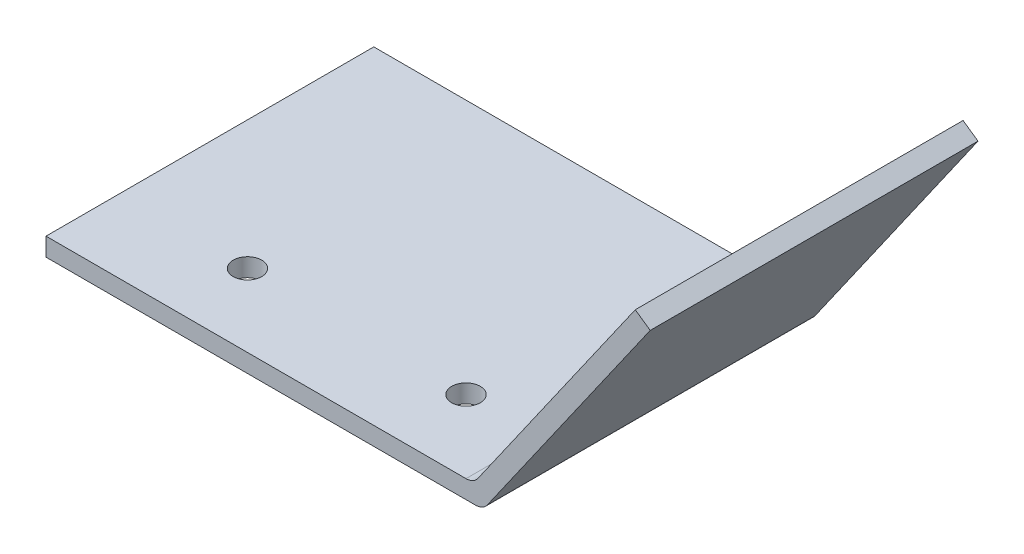
ISO-10303-21;
HEADER;
FILE_DESCRIPTION(('STEP AP214'),'2;1');
FILE_NAME('part.step','',(''),(''),'','','');
FILE_SCHEMA(('AUTOMOTIVE_DESIGN { 1 0 10303 214 1 1 1 1 }'));
ENDSEC;
DATA;
#1=APPLICATION_CONTEXT('core data for automotive mechanical design processes');
#2=APPLICATION_PROTOCOL_DEFINITION('international standard','automotive_design',2000,#1);
#3=PRODUCT_CONTEXT('',#1,'mechanical');
#4=PRODUCT('Part','Part','',(#3));
#5=PRODUCT_RELATED_PRODUCT_CATEGORY('part','',(#4));
#6=PRODUCT_DEFINITION_FORMATION('','',#4);
#7=PRODUCT_DEFINITION_CONTEXT('part definition',#1,'design');
#8=PRODUCT_DEFINITION('design','',#6,#7);
#9=PRODUCT_DEFINITION_SHAPE('','',#8);
#10=(LENGTH_UNIT() NAMED_UNIT(*) SI_UNIT(.MILLI.,.METRE.));
#11=(NAMED_UNIT(*) PLANE_ANGLE_UNIT() SI_UNIT($,.RADIAN.));
#12=(NAMED_UNIT(*) SI_UNIT($,.STERADIAN.) SOLID_ANGLE_UNIT());
#13=UNCERTAINTY_MEASURE_WITH_UNIT(LENGTH_MEASURE(1.E-05),#10,'distance_accuracy_value','');
#14=(GEOMETRIC_REPRESENTATION_CONTEXT(3) GLOBAL_UNCERTAINTY_ASSIGNED_CONTEXT((#13)) GLOBAL_UNIT_ASSIGNED_CONTEXT((#10,
#11,#12)) REPRESENTATION_CONTEXT('',''));
#15=CARTESIAN_POINT('',(0.,0.,0.));
#16=DIRECTION('',(0.,0.,1.));
#17=DIRECTION('',(1.,0.,0.));
#18=AXIS2_PLACEMENT_3D('',#15,#16,#17);
#19=CARTESIAN_POINT('',(0.,0.,28.575));
#20=DIRECTION('',(0.,1.,0.));
#21=DIRECTION('',(0.,0.,1.));
#22=AXIS2_PLACEMENT_3D('',#19,#20,#21);
#23=PLANE('',#22);
#24=CARTESIAN_POINT('',(60.5249593060967,0.,15.875));
#25=DIRECTION('',(0.,1.,0.));
#26=DIRECTION('',(0.,0.,1.));
#27=AXIS2_PLACEMENT_3D('',#24,#25,#26);
#28=CIRCLE('',#27,2.4892);
#29=CARTESIAN_POINT('',(60.5249593060967,0.,18.3642));
#30=VERTEX_POINT('',#29);
#31=EDGE_CURVE('E138',#30,#30,#28,.T.);
#32=ORIENTED_EDGE('',*,*,#31,.T.);
#33=EDGE_LOOP('',(#32));
#34=FACE_BOUND('',#33,.T.);
#35=CARTESIAN_POINT('',(22.4249593060967,0.,15.875));
#36=DIRECTION('',(0.,1.,0.));
#37=DIRECTION('',(0.,0.,1.));
#38=AXIS2_PLACEMENT_3D('',#35,#36,#37);
#39=CIRCLE('',#38,2.4892);
#40=CARTESIAN_POINT('',(22.4249593060967,0.,18.3642));
#41=VERTEX_POINT('',#40);
#42=EDGE_CURVE('E223',#41,#41,#39,.T.);
#43=ORIENTED_EDGE('',*,*,#42,.T.);
#44=EDGE_LOOP('',(#43));
#45=FACE_BOUND('',#44,.T.);
#46=DIRECTION('',(1.,0.,0.));
#47=VECTOR('',#46,1.);
#48=CARTESIAN_POINT('',(0.,0.,-28.575));
#49=LINE('',#48,#47);
#50=CARTESIAN_POINT('',(0.,0.,-28.575));
#51=VERTEX_POINT('',#50);
#52=CARTESIAN_POINT('',(74.8777596915985,0.,-28.575));
#53=VERTEX_POINT('',#52);
#54=EDGE_CURVE('E136',#51,#53,#49,.T.);
#55=ORIENTED_EDGE('',*,*,#54,.T.);
#56=DIRECTION('',(0.,0.,-1.));
#57=VECTOR('',#56,1.);
#58=CARTESIAN_POINT('',(74.8777596915985,0.,28.575));
#59=LINE('',#58,#57);
#60=CARTESIAN_POINT('',(74.8777596915985,0.,28.575));
#61=VERTEX_POINT('',#60);
#62=EDGE_CURVE('E42',#53,#61,#59,.F.);
#63=ORIENTED_EDGE('',*,*,#62,.T.);
#64=DIRECTION('',(1.,0.,0.));
#65=VECTOR('',#64,1.);
#66=CARTESIAN_POINT('',(0.,0.,28.575));
#67=LINE('',#66,#65);
#68=CARTESIAN_POINT('',(0.,0.,28.575));
#69=VERTEX_POINT('',#68);
#70=EDGE_CURVE('E109',#69,#61,#67,.T.);
#71=ORIENTED_EDGE('',*,*,#70,.F.);
#72=DIRECTION('',(0.,0.,-1.));
#73=VECTOR('',#72,1.);
#74=CARTESIAN_POINT('',(0.,0.,28.575));
#75=LINE('',#74,#73);
#76=EDGE_CURVE('E135',#69,#51,#75,.T.);
#77=ORIENTED_EDGE('',*,*,#76,.T.);
#78=EDGE_LOOP('',(#55,#63,#71,#77));
#79=FACE_BOUND('',#78,.T.);
#80=ADVANCED_FACE('F34',(#34,#45,#79),#23,.F.);
#81=CARTESIAN_POINT('',(51.1309674607082,-35.802288851943,28.575));
#82=DIRECTION('',(-0.819152044288994,0.573576436351044,0.));
#83=DIRECTION('',(-0.573576436351044,-0.819152044288994,0.));
#84=AXIS2_PLACEMENT_3D('',#81,#82,#83);
#85=PLANE('',#84);
#86=DIRECTION('',(0.573576436351044,0.819152044288994,0.));
#87=VECTOR('',#86,1.);
#88=CARTESIAN_POINT('',(51.1309674607082,-35.802288851943,28.575));
#89=LINE('',#88,#87);
#90=CARTESIAN_POINT('',(76.9584058840926,1.08311585166835,28.575));
#91=VERTEX_POINT('',#90);
#92=CARTESIAN_POINT('',(105.337682966633,41.6129238498809,28.575));
#93=VERTEX_POINT('',#92);
#94=EDGE_CURVE('E99',#91,#93,#89,.T.);
#95=ORIENTED_EDGE('',*,*,#94,.F.);
#96=DIRECTION('',(0.,0.,-1.));
#97=VECTOR('',#96,1.);
#98=CARTESIAN_POINT('',(76.9584058840926,1.08311585166835,28.575));
#99=LINE('',#98,#97);
#100=CARTESIAN_POINT('',(76.9584058840926,1.08311585166835,-28.575));
#101=VERTEX_POINT('',#100);
#102=EDGE_CURVE('E162',#91,#101,#99,.T.);
#103=ORIENTED_EDGE('',*,*,#102,.T.);
#104=DIRECTION('',(0.573576436351044,0.819152044288994,0.));
#105=VECTOR('',#104,1.);
#106=CARTESIAN_POINT('',(51.1309674607082,-35.802288851943,-28.575));
#107=LINE('',#106,#105);
#108=CARTESIAN_POINT('',(105.337682966633,41.6129238498809,-28.575));
#109=VERTEX_POINT('',#108);
#110=EDGE_CURVE('E114',#101,#109,#107,.T.);
#111=ORIENTED_EDGE('',*,*,#110,.T.);
#112=DIRECTION('',(0.,0.,-1.));
#113=VECTOR('',#112,1.);
#114=CARTESIAN_POINT('',(105.337682966633,41.6129238498809,28.575));
#115=LINE('',#114,#113);
#116=EDGE_CURVE('E112',#93,#109,#115,.T.);
#117=ORIENTED_EDGE('',*,*,#116,.F.);
#118=EDGE_LOOP('',(#95,#103,#111,#117));
#119=FACE_BOUND('',#118,.T.);
#120=ADVANCED_FACE('F113',(#119),#85,.F.);
#121=CARTESIAN_POINT('',(54.2067155059246,77.4152127018239,28.575));
#122=DIRECTION('',(0.573576436351043,0.819152044288994,0.));
#123=DIRECTION('',(-0.819152044288994,0.573576436351043,0.));
#124=AXIS2_PLACEMENT_3D('',#121,#122,#123);
#125=PLANE('',#124);
#126=DIRECTION('',(0.819152044288994,-0.573576436351042,0.));
#127=VECTOR('',#126,1.);
#128=CARTESIAN_POINT('',(54.2067155059246,77.4152127018239,-28.575));
#129=LINE('',#128,#127);
#130=CARTESIAN_POINT('',(102.736875226015,43.4340290352954,-28.575));
#131=VERTEX_POINT('',#130);
#132=EDGE_CURVE('E140',#131,#109,#129,.T.);
#133=ORIENTED_EDGE('',*,*,#132,.F.);
#134=DIRECTION('',(0.,0.,-1.));
#135=VECTOR('',#134,1.);
#136=CARTESIAN_POINT('',(102.736875226015,43.4340290352954,28.575));
#137=LINE('',#136,#135);
#138=CARTESIAN_POINT('',(102.736875226015,43.4340290352954,28.575));
#139=VERTEX_POINT('',#138);
#140=EDGE_CURVE('E119',#139,#131,#137,.T.);
#141=ORIENTED_EDGE('',*,*,#140,.F.);
#142=DIRECTION('',(0.819152044288994,-0.573576436351042,0.));
#143=VECTOR('',#142,1.);
#144=CARTESIAN_POINT('',(54.2067155059246,77.4152127018239,28.575));
#145=LINE('',#144,#143);
#146=EDGE_CURVE('E104',#139,#93,#145,.T.);
#147=ORIENTED_EDGE('',*,*,#146,.T.);
#148=ORIENTED_EDGE('',*,*,#116,.T.);
#149=EDGE_LOOP('',(#133,#141,#147,#148));
#150=FACE_BOUND('',#149,.T.);
#151=ADVANCED_FACE('F122',(#150),#125,.T.);
#152=CARTESIAN_POINT('',(48.5301597200906,-33.9811836665285,28.575));
#153=DIRECTION('',(-0.819152044288993,0.573576436351044,0.));
#154=DIRECTION('',(-0.573576436351044,-0.819152044288993,0.));
#155=AXIS2_PLACEMENT_3D('',#152,#153,#154);
#156=PLANE('',#155);
#157=DIRECTION('',(0.573576436351044,0.819152044288994,0.));
#158=VECTOR('',#157,1.);
#159=CARTESIAN_POINT('',(48.5301597200906,-33.9811836665285,-28.575));
#160=LINE('',#159,#158);
#161=CARTESIAN_POINT('',(75.3056054985908,4.25811585166837,-28.575));
#162=VERTEX_POINT('',#161);
#163=EDGE_CURVE('E142',#162,#131,#160,.T.);
#164=ORIENTED_EDGE('',*,*,#163,.F.);
#165=DIRECTION('',(0.,0.,-1.));
#166=VECTOR('',#165,1.);
#167=CARTESIAN_POINT('',(75.3056054985908,4.25811585166835,28.575));
#168=LINE('',#167,#166);
#169=CARTESIAN_POINT('',(75.3056054985908,4.25811585166837,28.575));
#170=VERTEX_POINT('',#169);
#171=EDGE_CURVE('E156',#162,#170,#168,.F.);
#172=ORIENTED_EDGE('',*,*,#171,.T.);
#173=DIRECTION('',(0.573576436351044,0.819152044288994,0.));
#174=VECTOR('',#173,1.);
#175=CARTESIAN_POINT('',(48.5301597200906,-33.9811836665285,28.575));
#176=LINE('',#175,#174);
#177=EDGE_CURVE('E124',#170,#139,#176,.T.);
#178=ORIENTED_EDGE('',*,*,#177,.T.);
#179=ORIENTED_EDGE('',*,*,#140,.T.);
#180=EDGE_LOOP('',(#164,#172,#178,#179));
#181=FACE_BOUND('',#180,.T.);
#182=ADVANCED_FACE('F169',(#181),#156,.T.);
#183=CARTESIAN_POINT('',(0.,3.175,28.575));
#184=DIRECTION('',(0.,1.,0.));
#185=DIRECTION('',(0.,0.,1.));
#186=AXIS2_PLACEMENT_3D('',#183,#184,#185);
#187=PLANE('',#186);
#188=CARTESIAN_POINT('',(60.5249593060967,3.175,15.875));
#189=DIRECTION('',(0.,1.,0.));
#190=DIRECTION('',(0.,0.,1.));
#191=AXIS2_PLACEMENT_3D('',#188,#189,#190);
#192=CIRCLE('',#191,2.4892);
#193=CARTESIAN_POINT('',(60.5249593060967,3.175,18.3642));
#194=VERTEX_POINT('',#193);
#195=EDGE_CURVE('E222',#194,#194,#192,.T.);
#196=ORIENTED_EDGE('',*,*,#195,.F.);
#197=EDGE_LOOP('',(#196));
#198=FACE_BOUND('',#197,.T.);
#199=CARTESIAN_POINT('',(22.4249593060967,3.175,15.875));
#200=DIRECTION('',(0.,1.,0.));
#201=DIRECTION('',(0.,0.,1.));
#202=AXIS2_PLACEMENT_3D('',#199,#200,#201);
#203=CIRCLE('',#202,2.4892);
#204=CARTESIAN_POINT('',(22.4249593060967,3.175,18.3642));
#205=VERTEX_POINT('',#204);
#206=EDGE_CURVE('E227',#205,#205,#203,.T.);
#207=ORIENTED_EDGE('',*,*,#206,.F.);
#208=EDGE_LOOP('',(#207));
#209=FACE_BOUND('',#208,.T.);
#210=DIRECTION('',(1.,0.,0.));
#211=VECTOR('',#210,1.);
#212=CARTESIAN_POINT('',(0.,3.175,28.575));
#213=LINE('',#212,#211);
#214=CARTESIAN_POINT('',(0.,3.175,28.575));
#215=VERTEX_POINT('',#214);
#216=CARTESIAN_POINT('',(73.2249593060967,3.175,28.575));
#217=VERTEX_POINT('',#216);
#218=EDGE_CURVE('E126',#215,#217,#213,.T.);
#219=ORIENTED_EDGE('',*,*,#218,.T.);
#220=DIRECTION('',(0.,0.,-1.));
#221=VECTOR('',#220,1.);
#222=CARTESIAN_POINT('',(73.2249593060967,3.175,-28.575));
#223=LINE('',#222,#221);
#224=CARTESIAN_POINT('',(73.2249593060967,3.175,-28.575));
#225=VERTEX_POINT('',#224);
#226=EDGE_CURVE('E118',#217,#225,#223,.T.);
#227=ORIENTED_EDGE('',*,*,#226,.T.);
#228=DIRECTION('',(1.,0.,0.));
#229=VECTOR('',#228,1.);
#230=CARTESIAN_POINT('',(0.,3.175,-28.575));
#231=LINE('',#230,#229);
#232=CARTESIAN_POINT('',(0.,3.175,-28.575));
#233=VERTEX_POINT('',#232);
#234=EDGE_CURVE('E144',#233,#225,#231,.T.);
#235=ORIENTED_EDGE('',*,*,#234,.F.);
#236=DIRECTION('',(0.,0.,-1.));
#237=VECTOR('',#236,1.);
#238=CARTESIAN_POINT('',(0.,3.175,28.575));
#239=LINE('',#238,#237);
#240=EDGE_CURVE('E151',#215,#233,#239,.T.);
#241=ORIENTED_EDGE('',*,*,#240,.F.);
#242=EDGE_LOOP('',(#219,#227,#235,#241));
#243=FACE_BOUND('',#242,.T.);
#244=ADVANCED_FACE('F177',(#198,#209,#243),#187,.T.);
#245=CARTESIAN_POINT('',(0.,0.,28.575));
#246=DIRECTION('',(-1.,0.,0.));
#247=DIRECTION('',(0.,0.,1.));
#248=AXIS2_PLACEMENT_3D('',#245,#246,#247);
#249=PLANE('',#248);
#250=DIRECTION('',(0.,1.,0.));
#251=VECTOR('',#250,1.);
#252=CARTESIAN_POINT('',(0.,0.,-28.575));
#253=LINE('',#252,#251);
#254=EDGE_CURVE('E147',#51,#233,#253,.T.);
#255=ORIENTED_EDGE('',*,*,#254,.F.);
#256=ORIENTED_EDGE('',*,*,#76,.F.);
#257=DIRECTION('',(0.,1.,0.));
#258=VECTOR('',#257,1.);
#259=CARTESIAN_POINT('',(0.,0.,28.575));
#260=LINE('',#259,#258);
#261=EDGE_CURVE('E132',#69,#215,#260,.T.);
#262=ORIENTED_EDGE('',*,*,#261,.T.);
#263=ORIENTED_EDGE('',*,*,#240,.T.);
#264=EDGE_LOOP('',(#255,#256,#262,#263));
#265=FACE_BOUND('',#264,.T.);
#266=ADVANCED_FACE('F180',(#265),#249,.T.);
#267=CARTESIAN_POINT('',(0.,0.,28.575));
#268=DIRECTION('',(0.,0.,1.));
#269=DIRECTION('',(1.,0.,0.));
#270=AXIS2_PLACEMENT_3D('',#267,#268,#269);
#271=PLANE('',#270);
#272=ORIENTED_EDGE('',*,*,#70,.T.);
#273=CARTESIAN_POINT('',(74.8777596915985,2.54,28.575));
#274=DIRECTION('',(0.,0.,1.));
#275=DIRECTION('',(1.,0.,0.));
#276=AXIS2_PLACEMENT_3D('',#273,#274,#275);
#277=CIRCLE('',#276,2.54);
#278=EDGE_CURVE('E11',#61,#91,#277,.T.);
#279=ORIENTED_EDGE('',*,*,#278,.T.);
#280=ORIENTED_EDGE('',*,*,#94,.T.);
#281=ORIENTED_EDGE('',*,*,#146,.F.);
#282=ORIENTED_EDGE('',*,*,#177,.F.);
#283=CARTESIAN_POINT('',(73.2249593060967,5.715,28.575));
#284=DIRECTION('',(0.,0.,1.));
#285=DIRECTION('',(1.,0.,0.));
#286=AXIS2_PLACEMENT_3D('',#283,#284,#285);
#287=CIRCLE('',#286,2.54);
#288=EDGE_CURVE('E160',#170,#217,#287,.F.);
#289=ORIENTED_EDGE('',*,*,#288,.T.);
#290=ORIENTED_EDGE('',*,*,#218,.F.);
#291=ORIENTED_EDGE('',*,*,#261,.F.);
#292=EDGE_LOOP('',(#272,#279,#280,#281,#282,#289,#290,#291));
#293=FACE_BOUND('',#292,.T.);
#294=ADVANCED_FACE('F101',(#293),#271,.T.);
#295=CARTESIAN_POINT('',(0.,0.,-28.575));
#296=DIRECTION('',(0.,0.,1.));
#297=DIRECTION('',(1.,0.,0.));
#298=AXIS2_PLACEMENT_3D('',#295,#296,#297);
#299=PLANE('',#298);
#300=ORIENTED_EDGE('',*,*,#110,.F.);
#301=CARTESIAN_POINT('',(74.8777596915985,2.54,-28.575));
#302=DIRECTION('',(0.,0.,1.));
#303=DIRECTION('',(1.,0.,0.));
#304=AXIS2_PLACEMENT_3D('',#301,#302,#303);
#305=CIRCLE('',#304,2.54);
#306=EDGE_CURVE('E56',#101,#53,#305,.F.);
#307=ORIENTED_EDGE('',*,*,#306,.T.);
#308=ORIENTED_EDGE('',*,*,#54,.F.);
#309=ORIENTED_EDGE('',*,*,#254,.T.);
#310=ORIENTED_EDGE('',*,*,#234,.T.);
#311=CARTESIAN_POINT('',(73.2249593060967,5.715,-28.575));
#312=DIRECTION('',(0.,0.,1.));
#313=DIRECTION('',(1.,0.,0.));
#314=AXIS2_PLACEMENT_3D('',#311,#312,#313);
#315=CIRCLE('',#314,2.54);
#316=EDGE_CURVE('E158',#225,#162,#315,.T.);
#317=ORIENTED_EDGE('',*,*,#316,.T.);
#318=ORIENTED_EDGE('',*,*,#163,.T.);
#319=ORIENTED_EDGE('',*,*,#132,.T.);
#320=EDGE_LOOP('',(#300,#307,#308,#309,#310,#317,#318,#319));
#321=FACE_BOUND('',#320,.T.);
#322=ADVANCED_FACE('F165',(#321),#299,.F.);
#323=CARTESIAN_POINT('',(73.2249593060967,5.715,28.575));
#324=DIRECTION('',(0.,0.,1.));
#325=DIRECTION('',(1.,0.,0.));
#326=AXIS2_PLACEMENT_3D('',#323,#324,#325);
#327=CYLINDRICAL_SURFACE('',#326,2.54);
#328=ORIENTED_EDGE('',*,*,#288,.F.);
#329=ORIENTED_EDGE('',*,*,#171,.F.);
#330=ORIENTED_EDGE('',*,*,#316,.F.);
#331=ORIENTED_EDGE('',*,*,#226,.F.);
#332=EDGE_LOOP('',(#328,#329,#330,#331));
#333=FACE_BOUND('',#332,.T.);
#334=ADVANCED_FACE('F174',(#333),#327,.F.);
#335=CARTESIAN_POINT('',(74.8777596915985,2.54,28.575));
#336=DIRECTION('',(0.,0.,-1.));
#337=DIRECTION('',(-1.,0.,0.));
#338=AXIS2_PLACEMENT_3D('',#335,#336,#337);
#339=CYLINDRICAL_SURFACE('',#338,2.54);
#340=ORIENTED_EDGE('',*,*,#278,.F.);
#341=ORIENTED_EDGE('',*,*,#62,.F.);
#342=ORIENTED_EDGE('',*,*,#306,.F.);
#343=ORIENTED_EDGE('',*,*,#102,.F.);
#344=EDGE_LOOP('',(#340,#341,#342,#343));
#345=FACE_BOUND('',#344,.T.);
#346=ADVANCED_FACE('F36',(#345),#339,.T.);
#347=CARTESIAN_POINT('',(22.4249593060967,0.,15.875));
#348=DIRECTION('',(0.,1.,0.));
#349=DIRECTION('',(0.,0.,1.));
#350=AXIS2_PLACEMENT_3D('',#347,#348,#349);
#351=CYLINDRICAL_SURFACE('',#350,2.4892);
#352=ORIENTED_EDGE('',*,*,#42,.F.);
#353=EDGE_LOOP('',(#352));
#354=FACE_BOUND('',#353,.T.);
#355=ORIENTED_EDGE('',*,*,#206,.T.);
#356=EDGE_LOOP('',(#355));
#357=FACE_BOUND('',#356,.T.);
#358=ADVANCED_FACE('F183',(#354,#357),#351,.F.);
#359=CARTESIAN_POINT('',(60.5249593060967,0.,15.875));
#360=DIRECTION('',(0.,1.,0.));
#361=DIRECTION('',(0.,0.,1.));
#362=AXIS2_PLACEMENT_3D('',#359,#360,#361);
#363=CYLINDRICAL_SURFACE('',#362,2.4892);
#364=ORIENTED_EDGE('',*,*,#31,.F.);
#365=EDGE_LOOP('',(#364));
#366=FACE_BOUND('',#365,.T.);
#367=ORIENTED_EDGE('',*,*,#195,.T.);
#368=EDGE_LOOP('',(#367));
#369=FACE_BOUND('',#368,.T.);
#370=ADVANCED_FACE('F188',(#366,#369),#363,.F.);
#371=CLOSED_SHELL('',(#80,#120,#151,#182,#244,#266,#294,#322,#334,#346,#358,#370));
#372=MANIFOLD_SOLID_BREP('B2',#371);
#373=ADVANCED_BREP_SHAPE_REPRESENTATION('',(#18,#372),#14);
#374=SHAPE_DEFINITION_REPRESENTATION(#9,#373);
ENDSEC;
END-ISO-10303-21;
